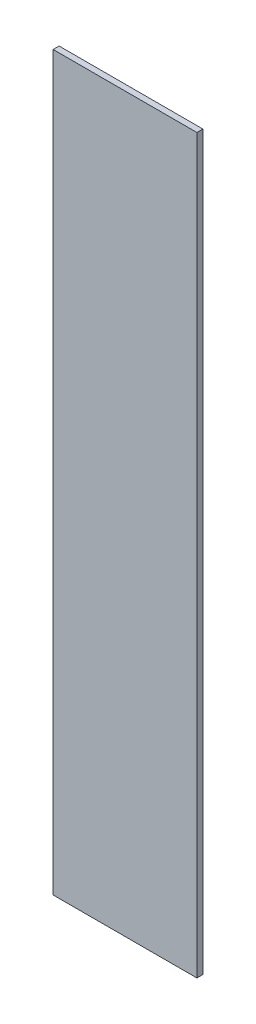
ISO-10303-21;
HEADER;
FILE_DESCRIPTION(('STEP AP214'),'2;1');
FILE_NAME('part.step','',(''),(''),'','','');
FILE_SCHEMA(('AUTOMOTIVE_DESIGN { 1 0 10303 214 1 1 1 1 }'));
ENDSEC;
DATA;
#1=APPLICATION_CONTEXT('core data for automotive mechanical design processes');
#2=APPLICATION_PROTOCOL_DEFINITION('international standard','automotive_design',2000,#1);
#3=PRODUCT_CONTEXT('',#1,'mechanical');
#4=PRODUCT('Part','Part','',(#3));
#5=PRODUCT_RELATED_PRODUCT_CATEGORY('part','',(#4));
#6=PRODUCT_DEFINITION_FORMATION('','',#4);
#7=PRODUCT_DEFINITION_CONTEXT('part definition',#1,'design');
#8=PRODUCT_DEFINITION('design','',#6,#7);
#9=PRODUCT_DEFINITION_SHAPE('','',#8);
#10=(LENGTH_UNIT() NAMED_UNIT(*) SI_UNIT(.MILLI.,.METRE.));
#11=(NAMED_UNIT(*) PLANE_ANGLE_UNIT() SI_UNIT($,.RADIAN.));
#12=(NAMED_UNIT(*) SI_UNIT($,.STERADIAN.) SOLID_ANGLE_UNIT());
#13=UNCERTAINTY_MEASURE_WITH_UNIT(LENGTH_MEASURE(1.E-05),#10,'distance_accuracy_value','');
#14=(GEOMETRIC_REPRESENTATION_CONTEXT(3) GLOBAL_UNCERTAINTY_ASSIGNED_CONTEXT((#13)) GLOBAL_UNIT_ASSIGNED_CONTEXT((#10,
#11,#12)) REPRESENTATION_CONTEXT('',''));
#15=CARTESIAN_POINT('',(0.,0.,0.));
#16=DIRECTION('',(0.,0.,1.));
#17=DIRECTION('',(1.,0.,0.));
#18=AXIS2_PLACEMENT_3D('',#15,#16,#17);
#19=CARTESIAN_POINT('',(0.,0.,18.));
#20=DIRECTION('',(1.,0.,0.));
#21=DIRECTION('',(0.,0.,-1.));
#22=AXIS2_PLACEMENT_3D('',#19,#20,#21);
#23=PLANE('',#22);
#24=DIRECTION('',(0.,-1.,0.));
#25=VECTOR('',#24,1.);
#26=CARTESIAN_POINT('',(0.,0.,0.));
#27=LINE('',#26,#25);
#28=CARTESIAN_POINT('',(0.,2200.,0.));
#29=VERTEX_POINT('',#28);
#30=CARTESIAN_POINT('',(0.,0.,0.));
#31=VERTEX_POINT('',#30);
#32=EDGE_CURVE('E96',#29,#31,#27,.T.);
#33=ORIENTED_EDGE('',*,*,#32,.T.);
#34=DIRECTION('',(0.,0.,-1.));
#35=VECTOR('',#34,1.);
#36=CARTESIAN_POINT('',(0.,0.,18.));
#37=LINE('',#36,#35);
#38=CARTESIAN_POINT('',(0.,0.,18.));
#39=VERTEX_POINT('',#38);
#40=EDGE_CURVE('E11',#39,#31,#37,.T.);
#41=ORIENTED_EDGE('',*,*,#40,.F.);
#42=DIRECTION('',(0.,-1.,0.));
#43=VECTOR('',#42,1.);
#44=CARTESIAN_POINT('',(0.,0.,18.));
#45=LINE('',#44,#43);
#46=CARTESIAN_POINT('',(0.,2200.,18.));
#47=VERTEX_POINT('',#46);
#48=EDGE_CURVE('E84',#47,#39,#45,.T.);
#49=ORIENTED_EDGE('',*,*,#48,.F.);
#50=DIRECTION('',(0.,0.,-1.));
#51=VECTOR('',#50,1.);
#52=CARTESIAN_POINT('',(0.,2200.,18.));
#53=LINE('',#52,#51);
#54=EDGE_CURVE('E92',#47,#29,#53,.T.);
#55=ORIENTED_EDGE('',*,*,#54,.T.);
#56=EDGE_LOOP('',(#33,#41,#49,#55));
#57=FACE_BOUND('',#56,.T.);
#58=ADVANCED_FACE('F33',(#57),#23,.F.);
#59=CARTESIAN_POINT('',(0.,0.,18.));
#60=DIRECTION('',(0.,1.,0.));
#61=DIRECTION('',(0.,0.,1.));
#62=AXIS2_PLACEMENT_3D('',#59,#60,#61);
#63=PLANE('',#62);
#64=DIRECTION('',(1.,0.,0.));
#65=VECTOR('',#64,1.);
#66=CARTESIAN_POINT('',(0.,0.,0.));
#67=LINE('',#66,#65);
#68=CARTESIAN_POINT('',(432.,0.,0.));
#69=VERTEX_POINT('',#68);
#70=EDGE_CURVE('E88',#31,#69,#67,.T.);
#71=ORIENTED_EDGE('',*,*,#70,.T.);
#72=DIRECTION('',(0.,0.,-1.));
#73=VECTOR('',#72,1.);
#74=CARTESIAN_POINT('',(432.,0.,18.));
#75=LINE('',#74,#73);
#76=CARTESIAN_POINT('',(432.,0.,18.));
#77=VERTEX_POINT('',#76);
#78=EDGE_CURVE('E41',#77,#69,#75,.T.);
#79=ORIENTED_EDGE('',*,*,#78,.F.);
#80=DIRECTION('',(1.,0.,0.));
#81=VECTOR('',#80,1.);
#82=CARTESIAN_POINT('',(0.,0.,18.));
#83=LINE('',#82,#81);
#84=EDGE_CURVE('E79',#39,#77,#83,.T.);
#85=ORIENTED_EDGE('',*,*,#84,.F.);
#86=ORIENTED_EDGE('',*,*,#40,.T.);
#87=EDGE_LOOP('',(#71,#79,#85,#86));
#88=FACE_BOUND('',#87,.T.);
#89=ADVANCED_FACE('F87',(#88),#63,.F.);
#90=CARTESIAN_POINT('',(432.,0.,18.));
#91=DIRECTION('',(-1.,0.,0.));
#92=DIRECTION('',(0.,0.,1.));
#93=AXIS2_PLACEMENT_3D('',#90,#91,#92);
#94=PLANE('',#93);
#95=DIRECTION('',(0.,1.,0.));
#96=VECTOR('',#95,1.);
#97=CARTESIAN_POINT('',(432.,0.,0.));
#98=LINE('',#97,#96);
#99=CARTESIAN_POINT('',(432.,2200.,0.));
#100=VERTEX_POINT('',#99);
#101=EDGE_CURVE('E66',#69,#100,#98,.T.);
#102=ORIENTED_EDGE('',*,*,#101,.T.);
#103=DIRECTION('',(0.,0.,-1.));
#104=VECTOR('',#103,1.);
#105=CARTESIAN_POINT('',(432.,2200.,18.));
#106=LINE('',#105,#104);
#107=CARTESIAN_POINT('',(432.,2200.,18.));
#108=VERTEX_POINT('',#107);
#109=EDGE_CURVE('E89',#108,#100,#106,.T.);
#110=ORIENTED_EDGE('',*,*,#109,.F.);
#111=DIRECTION('',(0.,1.,0.));
#112=VECTOR('',#111,1.);
#113=CARTESIAN_POINT('',(432.,0.,18.));
#114=LINE('',#113,#112);
#115=EDGE_CURVE('E82',#77,#108,#114,.T.);
#116=ORIENTED_EDGE('',*,*,#115,.F.);
#117=ORIENTED_EDGE('',*,*,#78,.T.);
#118=EDGE_LOOP('',(#102,#110,#116,#117));
#119=FACE_BOUND('',#118,.T.);
#120=ADVANCED_FACE('F90',(#119),#94,.F.);
#121=CARTESIAN_POINT('',(0.,2200.,18.));
#122=DIRECTION('',(0.,-1.,0.));
#123=DIRECTION('',(0.,0.,-1.));
#124=AXIS2_PLACEMENT_3D('',#121,#122,#123);
#125=PLANE('',#124);
#126=DIRECTION('',(-1.,0.,0.));
#127=VECTOR('',#126,1.);
#128=CARTESIAN_POINT('',(0.,2200.,0.));
#129=LINE('',#128,#127);
#130=EDGE_CURVE('E72',#100,#29,#129,.T.);
#131=ORIENTED_EDGE('',*,*,#130,.T.);
#132=ORIENTED_EDGE('',*,*,#54,.F.);
#133=DIRECTION('',(-1.,0.,0.));
#134=VECTOR('',#133,1.);
#135=CARTESIAN_POINT('',(0.,2200.,18.));
#136=LINE('',#135,#134);
#137=EDGE_CURVE('E49',#108,#47,#136,.T.);
#138=ORIENTED_EDGE('',*,*,#137,.F.);
#139=ORIENTED_EDGE('',*,*,#109,.T.);
#140=EDGE_LOOP('',(#131,#132,#138,#139));
#141=FACE_BOUND('',#140,.T.);
#142=ADVANCED_FACE('F103',(#141),#125,.F.);
#143=CARTESIAN_POINT('',(0.,0.,18.));
#144=DIRECTION('',(0.,0.,-1.));
#145=DIRECTION('',(-1.,0.,0.));
#146=AXIS2_PLACEMENT_3D('',#143,#144,#145);
#147=PLANE('',#146);
#148=ORIENTED_EDGE('',*,*,#48,.T.);
#149=ORIENTED_EDGE('',*,*,#84,.T.);
#150=ORIENTED_EDGE('',*,*,#115,.T.);
#151=ORIENTED_EDGE('',*,*,#137,.T.);
#152=EDGE_LOOP('',(#148,#149,#150,#151));
#153=FACE_BOUND('',#152,.T.);
#154=ADVANCED_FACE('F80',(#153),#147,.F.);
#155=CARTESIAN_POINT('',(0.,0.,0.));
#156=DIRECTION('',(0.,0.,-1.));
#157=DIRECTION('',(-1.,0.,0.));
#158=AXIS2_PLACEMENT_3D('',#155,#156,#157);
#159=PLANE('',#158);
#160=ORIENTED_EDGE('',*,*,#32,.F.);
#161=ORIENTED_EDGE('',*,*,#130,.F.);
#162=ORIENTED_EDGE('',*,*,#101,.F.);
#163=ORIENTED_EDGE('',*,*,#70,.F.);
#164=EDGE_LOOP('',(#160,#161,#162,#163));
#165=FACE_BOUND('',#164,.T.);
#166=ADVANCED_FACE('F106',(#165),#159,.T.);
#167=CLOSED_SHELL('',(#58,#89,#120,#142,#154,#166));
#168=MANIFOLD_SOLID_BREP('B2',#167);
#169=ADVANCED_BREP_SHAPE_REPRESENTATION('',(#18,#168),#14);
#170=SHAPE_DEFINITION_REPRESENTATION(#9,#169);
ENDSEC;
END-ISO-10303-21;
